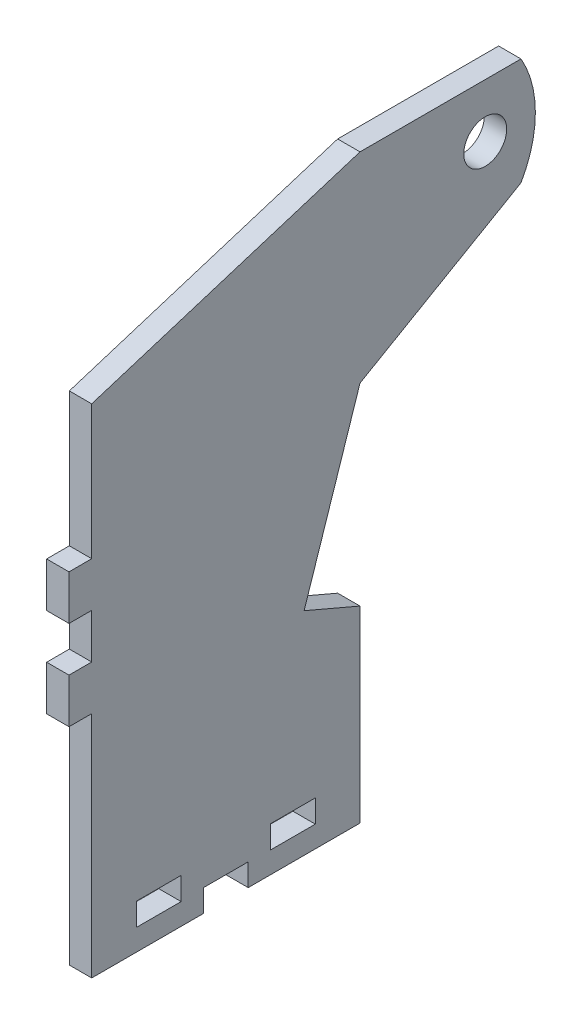
ISO-10303-21;
HEADER;
FILE_DESCRIPTION(('STEP AP214'),'2;1');
FILE_NAME('part.step','',(''),(''),'','','');
FILE_SCHEMA(('AUTOMOTIVE_DESIGN { 1 0 10303 214 1 1 1 1 }'));
ENDSEC;
DATA;
#1=APPLICATION_CONTEXT('core data for automotive mechanical design processes');
#2=APPLICATION_PROTOCOL_DEFINITION('international standard','automotive_design',2000,#1);
#3=PRODUCT_CONTEXT('',#1,'mechanical');
#4=PRODUCT('Part','Part','',(#3));
#5=PRODUCT_RELATED_PRODUCT_CATEGORY('part','',(#4));
#6=PRODUCT_DEFINITION_FORMATION('','',#4);
#7=PRODUCT_DEFINITION_CONTEXT('part definition',#1,'design');
#8=PRODUCT_DEFINITION('design','',#6,#7);
#9=PRODUCT_DEFINITION_SHAPE('','',#8);
#10=(LENGTH_UNIT() NAMED_UNIT(*) SI_UNIT(.MILLI.,.METRE.));
#11=(NAMED_UNIT(*) PLANE_ANGLE_UNIT() SI_UNIT($,.RADIAN.));
#12=(NAMED_UNIT(*) SI_UNIT($,.STERADIAN.) SOLID_ANGLE_UNIT());
#13=UNCERTAINTY_MEASURE_WITH_UNIT(LENGTH_MEASURE(1.E-05),#10,'distance_accuracy_value','');
#14=(GEOMETRIC_REPRESENTATION_CONTEXT(3) GLOBAL_UNCERTAINTY_ASSIGNED_CONTEXT((#13)) GLOBAL_UNIT_ASSIGNED_CONTEXT((#10,
#11,#12)) REPRESENTATION_CONTEXT('',''));
#15=CARTESIAN_POINT('',(0.,0.,0.));
#16=DIRECTION('',(0.,0.,1.));
#17=DIRECTION('',(1.,0.,0.));
#18=AXIS2_PLACEMENT_3D('',#15,#16,#17);
#19=CARTESIAN_POINT('',(3.175,-54.6326713443464,8.90133567217664));
#20=DIRECTION('',(0.,0.,-1.));
#21=DIRECTION('',(0.,1.,0.));
#22=AXIS2_PLACEMENT_3D('',#19,#20,#21);
#23=PLANE('',#22);
#24=DIRECTION('',(0.,-1.,0.));
#25=VECTOR('',#24,1.);
#26=CARTESIAN_POINT('',(0.,-54.6326713443464,8.90133567217664));
#27=LINE('',#26,#25);
#28=CARTESIAN_POINT('',(0.,-9.42067134434636,8.90133567217664));
#29=VERTEX_POINT('',#28);
#30=CARTESIAN_POINT('',(0.,-15.7706713443464,8.90133567217664));
#31=VERTEX_POINT('',#30);
#32=EDGE_CURVE('E295',#29,#31,#27,.T.);
#33=ORIENTED_EDGE('',*,*,#32,.T.);
#34=DIRECTION('',(-1.,0.,0.));
#35=VECTOR('',#34,1.);
#36=CARTESIAN_POINT('',(3.175,-15.7706713443464,8.90133567217664));
#37=LINE('',#36,#35);
#38=CARTESIAN_POINT('',(3.175,-15.7706713443464,8.90133567217664));
#39=VERTEX_POINT('',#38);
#40=EDGE_CURVE('E60',#39,#31,#37,.T.);
#41=ORIENTED_EDGE('',*,*,#40,.F.);
#42=DIRECTION('',(0.,-1.,0.));
#43=VECTOR('',#42,1.);
#44=CARTESIAN_POINT('',(3.175,-54.6326713443464,8.90133567217664));
#45=LINE('',#44,#43);
#46=CARTESIAN_POINT('',(3.175,-9.42067134434636,8.90133567217664));
#47=VERTEX_POINT('',#46);
#48=EDGE_CURVE('E313',#47,#39,#45,.T.);
#49=ORIENTED_EDGE('',*,*,#48,.F.);
#50=DIRECTION('',(-1.,0.,0.));
#51=VECTOR('',#50,1.);
#52=CARTESIAN_POINT('',(3.175,-9.42067134434636,8.90133567217664));
#53=LINE('',#52,#51);
#54=EDGE_CURVE('E287',#47,#29,#53,.T.);
#55=ORIENTED_EDGE('',*,*,#54,.T.);
#56=EDGE_LOOP('',(#33,#41,#49,#55));
#57=FACE_BOUND('',#56,.T.);
#58=ADVANCED_FACE('F35',(#57),#23,.F.);
#59=DIRECTION('',(-1.,0.,0.));
#60=VECTOR('',#59,1.);
#61=CARTESIAN_POINT('',(3.175,-3.07067134434636,8.90133567217664));
#62=LINE('',#61,#60);
#63=CARTESIAN_POINT('',(3.175,-3.07067134434636,8.90133567217664));
#64=VERTEX_POINT('',#63);
#65=CARTESIAN_POINT('',(0.,-3.07067134434636,8.90133567217664));
#66=VERTEX_POINT('',#65);
#67=EDGE_CURVE('E280',#64,#66,#62,.T.);
#68=ORIENTED_EDGE('',*,*,#67,.F.);
#69=CARTESIAN_POINT('',(3.175,15.9793286556536,8.90133567217664));
#70=VERTEX_POINT('',#69);
#71=EDGE_CURVE('E315',#70,#64,#45,.T.);
#72=ORIENTED_EDGE('',*,*,#71,.F.);
#73=DIRECTION('',(-1.,0.,0.));
#74=VECTOR('',#73,1.);
#75=CARTESIAN_POINT('',(3.175,15.9793286556536,8.90133567217664));
#76=LINE('',#75,#74);
#77=CARTESIAN_POINT('',(0.,15.9793286556536,8.90133567217664));
#78=VERTEX_POINT('',#77);
#79=EDGE_CURVE('E823',#70,#78,#76,.T.);
#80=ORIENTED_EDGE('',*,*,#79,.T.);
#81=EDGE_CURVE('E309',#78,#66,#27,.T.);
#82=ORIENTED_EDGE('',*,*,#81,.T.);
#83=EDGE_LOOP('',(#68,#72,#80,#82));
#84=FACE_BOUND('',#83,.T.);
#85=ADVANCED_FACE('F499',(#84),#23,.F.);
#86=CARTESIAN_POINT('',(3.175,-54.6326713443464,8.90133567217664));
#87=DIRECTION('',(0.,1.,0.));
#88=DIRECTION('',(0.,0.,1.));
#89=AXIS2_PLACEMENT_3D('',#86,#87,#88);
#90=PLANE('',#89);
#91=DIRECTION('',(0.,0.,-1.));
#92=VECTOR('',#91,1.);
#93=CARTESIAN_POINT('',(0.,-54.6326713443464,8.90133567217664));
#94=LINE('',#93,#92);
#95=CARTESIAN_POINT('',(0.,-54.6326713443464,8.90133567217664));
#96=VERTEX_POINT('',#95);
#97=CARTESIAN_POINT('',(0.,-54.6326713443464,-6.97366432782337));
#98=VERTEX_POINT('',#97);
#99=EDGE_CURVE('E302',#96,#98,#94,.T.);
#100=ORIENTED_EDGE('',*,*,#99,.T.);
#101=DIRECTION('',(1.,0.,0.));
#102=VECTOR('',#101,1.);
#103=CARTESIAN_POINT('',(0.,-54.6326713443464,-6.97366432782337));
#104=LINE('',#103,#102);
#105=CARTESIAN_POINT('',(3.175,-54.6326713443464,-6.97366432782337));
#106=VERTEX_POINT('',#105);
#107=EDGE_CURVE('E384',#98,#106,#104,.T.);
#108=ORIENTED_EDGE('',*,*,#107,.T.);
#109=DIRECTION('',(0.,0.,-1.));
#110=VECTOR('',#109,1.);
#111=CARTESIAN_POINT('',(3.175,-54.6326713443464,8.90133567217664));
#112=LINE('',#111,#110);
#113=CARTESIAN_POINT('',(3.175,-54.6326713443464,8.90133567217664));
#114=VERTEX_POINT('',#113);
#115=EDGE_CURVE('E321',#114,#106,#112,.T.);
#116=ORIENTED_EDGE('',*,*,#115,.F.);
#117=DIRECTION('',(-1.,0.,0.));
#118=VECTOR('',#117,1.);
#119=CARTESIAN_POINT('',(3.175,-54.6326713443464,8.90133567217664));
#120=LINE('',#119,#118);
#121=EDGE_CURVE('E11',#114,#96,#120,.T.);
#122=ORIENTED_EDGE('',*,*,#121,.T.);
#123=EDGE_LOOP('',(#100,#108,#116,#122));
#124=FACE_BOUND('',#123,.T.);
#125=ADVANCED_FACE('F383',(#124),#90,.F.);
#126=CARTESIAN_POINT('',(3.175,-22.1206713443464,8.90133567217664));
#127=VERTEX_POINT('',#126);
#128=EDGE_CURVE('E39',#127,#114,#45,.T.);
#129=ORIENTED_EDGE('',*,*,#128,.F.);
#130=DIRECTION('',(-1.,0.,0.));
#131=VECTOR('',#130,1.);
#132=CARTESIAN_POINT('',(3.175,-22.1206713443464,8.90133567217664));
#133=LINE('',#132,#131);
#134=CARTESIAN_POINT('',(0.,-22.1206713443464,8.90133567217664));
#135=VERTEX_POINT('',#134);
#136=EDGE_CURVE('E242',#127,#135,#133,.T.);
#137=ORIENTED_EDGE('',*,*,#136,.T.);
#138=EDGE_CURVE('E293',#135,#96,#27,.T.);
#139=ORIENTED_EDGE('',*,*,#138,.T.);
#140=ORIENTED_EDGE('',*,*,#121,.F.);
#141=EDGE_LOOP('',(#129,#137,#139,#140));
#142=FACE_BOUND('',#141,.T.);
#143=ADVANCED_FACE('F37',(#142),#23,.F.);
#144=CARTESIAN_POINT('',(3.175,-54.6326713443464,-13.3236643278234));
#145=VERTEX_POINT('',#144);
#146=CARTESIAN_POINT('',(3.175,-54.6326713443464,-29.1986643278234));
#147=VERTEX_POINT('',#146);
#148=EDGE_CURVE('E327',#145,#147,#112,.T.);
#149=ORIENTED_EDGE('',*,*,#148,.F.);
#150=DIRECTION('',(1.,0.,0.));
#151=VECTOR('',#150,1.);
#152=CARTESIAN_POINT('',(0.,-54.6326713443464,-13.3236643278234));
#153=LINE('',#152,#151);
#154=CARTESIAN_POINT('',(0.,-54.6326713443464,-13.3236643278234));
#155=VERTEX_POINT('',#154);
#156=EDGE_CURVE('E392',#155,#145,#153,.T.);
#157=ORIENTED_EDGE('',*,*,#156,.F.);
#158=CARTESIAN_POINT('',(0.,-54.6326713443464,-29.1986643278234));
#159=VERTEX_POINT('',#158);
#160=EDGE_CURVE('E312',#155,#159,#94,.T.);
#161=ORIENTED_EDGE('',*,*,#160,.T.);
#162=DIRECTION('',(-1.,0.,0.));
#163=VECTOR('',#162,1.);
#164=CARTESIAN_POINT('',(3.175,-54.6326713443464,-29.1986643278234));
#165=LINE('',#164,#163);
#166=EDGE_CURVE('E45',#147,#159,#165,.T.);
#167=ORIENTED_EDGE('',*,*,#166,.F.);
#168=EDGE_LOOP('',(#149,#157,#161,#167));
#169=FACE_BOUND('',#168,.T.);
#170=ADVANCED_FACE('F505',(#169),#90,.F.);
#171=CARTESIAN_POINT('',(3.175,-54.6326713443464,-29.1986643278234));
#172=DIRECTION('',(0.,0.,1.));
#173=DIRECTION('',(1.,0.,0.));
#174=AXIS2_PLACEMENT_3D('',#171,#172,#173);
#175=PLANE('',#174);
#176=DIRECTION('',(0.,1.,0.));
#177=VECTOR('',#176,1.);
#178=CARTESIAN_POINT('',(0.,-54.6326713443464,-29.1986643278234));
#179=LINE('',#178,#177);
#180=CARTESIAN_POINT('',(0.,-27.9395232465611,-29.1986643278234));
#181=VERTEX_POINT('',#180);
#182=EDGE_CURVE('E359',#159,#181,#179,.T.);
#183=ORIENTED_EDGE('',*,*,#182,.T.);
#184=DIRECTION('',(1.,0.,0.));
#185=VECTOR('',#184,1.);
#186=CARTESIAN_POINT('',(0.,-27.9395232465611,-29.1986643278234));
#187=LINE('',#186,#185);
#188=CARTESIAN_POINT('',(3.175,-27.9395232465611,-29.1986643278234));
#189=VERTEX_POINT('',#188);
#190=EDGE_CURVE('E404',#181,#189,#187,.T.);
#191=ORIENTED_EDGE('',*,*,#190,.T.);
#192=DIRECTION('',(0.,1.,0.));
#193=VECTOR('',#192,1.);
#194=CARTESIAN_POINT('',(3.175,-54.6326713443464,-29.1986643278234));
#195=LINE('',#194,#193);
#196=EDGE_CURVE('E326',#147,#189,#195,.T.);
#197=ORIENTED_EDGE('',*,*,#196,.F.);
#198=ORIENTED_EDGE('',*,*,#166,.T.);
#199=EDGE_LOOP('',(#183,#191,#197,#198));
#200=FACE_BOUND('',#199,.T.);
#201=ADVANCED_FACE('F357',(#200),#175,.F.);
#202=CARTESIAN_POINT('',(3.175,12.6773286556536,-52.0586643278234));
#203=DIRECTION('',(0.,0.866025403784436,0.500000000000004));
#204=DIRECTION('',(0.,-0.500000000000004,0.866025403784436));
#205=AXIS2_PLACEMENT_3D('',#202,#203,#204);
#206=PLANE('',#205);
#207=DIRECTION('',(0.,0.500000000000004,-0.866025403784436));
#208=VECTOR('',#207,1.);
#209=CARTESIAN_POINT('',(0.,12.6773286556536,-52.0586643278234));
#210=LINE('',#209,#208);
#211=CARTESIAN_POINT('',(0.,-0.520898498021683,-29.1986643278236));
#212=VERTEX_POINT('',#211);
#213=CARTESIAN_POINT('',(0.,12.6773286556536,-52.0586643278234));
#214=VERTEX_POINT('',#213);
#215=EDGE_CURVE('E371',#212,#214,#210,.T.);
#216=ORIENTED_EDGE('',*,*,#215,.T.);
#217=DIRECTION('',(-1.,0.,0.));
#218=VECTOR('',#217,1.);
#219=CARTESIAN_POINT('',(3.175,12.6773286556536,-52.0586643278234));
#220=LINE('',#219,#218);
#221=CARTESIAN_POINT('',(3.175,12.6773286556536,-52.0586643278234));
#222=VERTEX_POINT('',#221);
#223=EDGE_CURVE('E338',#222,#214,#220,.T.);
#224=ORIENTED_EDGE('',*,*,#223,.F.);
#225=DIRECTION('',(0.,0.500000000000004,-0.866025403784436));
#226=VECTOR('',#225,1.);
#227=CARTESIAN_POINT('',(3.175,12.6773286556536,-52.0586643278234));
#228=LINE('',#227,#226);
#229=CARTESIAN_POINT('',(3.175,-0.520898498021683,-29.1986643278236));
#230=VERTEX_POINT('',#229);
#231=EDGE_CURVE('E330',#230,#222,#228,.T.);
#232=ORIENTED_EDGE('',*,*,#231,.F.);
#233=DIRECTION('',(-1.,0.,0.));
#234=VECTOR('',#233,1.);
#235=CARTESIAN_POINT('',(3.175,-0.520898498021349,-29.1986643278234));
#236=LINE('',#235,#234);
#237=EDGE_CURVE('E343',#230,#212,#236,.T.);
#238=ORIENTED_EDGE('',*,*,#237,.T.);
#239=EDGE_LOOP('',(#216,#224,#232,#238));
#240=FACE_BOUND('',#239,.T.);
#241=ADVANCED_FACE('F515',(#240),#206,.F.);
#242=CARTESIAN_POINT('',(3.175,20.2973286556536,-38.8604371741485));
#243=DIRECTION('',(-1.,0.,0.));
#244=DIRECTION('',(0.,0.,1.));
#245=AXIS2_PLACEMENT_3D('',#242,#243,#244);
#246=CYLINDRICAL_SURFACE('',#245,15.24);
#247=CARTESIAN_POINT('',(0.,20.2973286556536,-38.8604371741485));
#248=DIRECTION('',(1.,0.,0.));
#249=DIRECTION('',(0.,0.,1.));
#250=AXIS2_PLACEMENT_3D('',#247,#248,#249);
#251=CIRCLE('',#250,15.24);
#252=CARTESIAN_POINT('',(0.,27.9173286556536,-52.0586643278234));
#253=VERTEX_POINT('',#252);
#254=EDGE_CURVE('E372',#214,#253,#251,.T.);
#255=ORIENTED_EDGE('',*,*,#254,.T.);
#256=DIRECTION('',(-1.,0.,0.));
#257=VECTOR('',#256,1.);
#258=CARTESIAN_POINT('',(3.175,27.9173286556536,-52.0586643278234));
#259=LINE('',#258,#257);
#260=CARTESIAN_POINT('',(3.175,27.9173286556536,-52.0586643278234));
#261=VERTEX_POINT('',#260);
#262=EDGE_CURVE('E334',#261,#253,#259,.T.);
#263=ORIENTED_EDGE('',*,*,#262,.F.);
#264=CARTESIAN_POINT('',(3.175,20.2973286556536,-38.8604371741485));
#265=DIRECTION('',(1.,0.,0.));
#266=DIRECTION('',(0.,0.,1.));
#267=AXIS2_PLACEMENT_3D('',#264,#265,#266);
#268=CIRCLE('',#267,15.24);
#269=EDGE_CURVE('E331',#222,#261,#268,.T.);
#270=ORIENTED_EDGE('',*,*,#269,.F.);
#271=ORIENTED_EDGE('',*,*,#223,.T.);
#272=EDGE_LOOP('',(#255,#263,#270,#271));
#273=FACE_BOUND('',#272,.T.);
#274=ADVANCED_FACE('F493',(#273),#246,.T.);
#275=CARTESIAN_POINT('',(3.175,27.9173286556536,8.90133567217664));
#276=DIRECTION('',(0.,-1.,0.));
#277=DIRECTION('',(0.,0.,-1.));
#278=AXIS2_PLACEMENT_3D('',#275,#276,#277);
#279=PLANE('',#278);
#280=DIRECTION('',(0.,0.,1.));
#281=VECTOR('',#280,1.);
#282=CARTESIAN_POINT('',(0.,27.9173286556536,8.90133567217664));
#283=LINE('',#282,#281);
#284=CARTESIAN_POINT('',(0.,27.9173286556536,-29.1986643278234));
#285=VERTEX_POINT('',#284);
#286=EDGE_CURVE('E346',#253,#285,#283,.T.);
#287=ORIENTED_EDGE('',*,*,#286,.T.);
#288=DIRECTION('',(-1.,0.,0.));
#289=VECTOR('',#288,1.);
#290=CARTESIAN_POINT('',(3.175,27.9173286556536,-29.1986643278234));
#291=LINE('',#290,#289);
#292=CARTESIAN_POINT('',(3.175,27.9173286556536,-29.1986643278234));
#293=VERTEX_POINT('',#292);
#294=EDGE_CURVE('E841',#293,#285,#291,.T.);
#295=ORIENTED_EDGE('',*,*,#294,.F.);
#296=DIRECTION('',(0.,0.,1.));
#297=VECTOR('',#296,1.);
#298=CARTESIAN_POINT('',(3.175,27.9173286556536,-29.1986643278234));
#299=LINE('',#298,#297);
#300=EDGE_CURVE('E300',#261,#293,#299,.T.);
#301=ORIENTED_EDGE('',*,*,#300,.F.);
#302=ORIENTED_EDGE('',*,*,#262,.T.);
#303=EDGE_LOOP('',(#287,#295,#301,#302));
#304=FACE_BOUND('',#303,.T.);
#305=ADVANCED_FACE('F485',(#304),#279,.F.);
#306=CARTESIAN_POINT('',(3.175,20.2973286556536,-38.8604371741485));
#307=DIRECTION('',(-1.,0.,0.));
#308=DIRECTION('',(0.,0.,1.));
#309=AXIS2_PLACEMENT_3D('',#306,#307,#308);
#310=PLANE('',#309);
#311=DIRECTION('',(0.,0.,1.));
#312=VECTOR('',#311,1.);
#313=CARTESIAN_POINT('',(3.175,-48.3588713443464,-16.4986643278236));
#314=LINE('',#313,#312);
#315=CARTESIAN_POINT('',(3.175,-48.3588713443464,-22.8486643278234));
#316=VERTEX_POINT('',#315);
#317=CARTESIAN_POINT('',(3.175,-48.3588713443464,-16.4986643278236));
#318=VERTEX_POINT('',#317);
#319=EDGE_CURVE('E429',#316,#318,#314,.T.);
#320=ORIENTED_EDGE('',*,*,#319,.F.);
#321=DIRECTION('',(0.,1.,0.));
#322=VECTOR('',#321,1.);
#323=CARTESIAN_POINT('',(3.175,-51.5846713443464,-22.8486643278234));
#324=LINE('',#323,#322);
#325=CARTESIAN_POINT('',(3.175,-51.5846713443464,-22.8486643278234));
#326=VERTEX_POINT('',#325);
#327=EDGE_CURVE('E410',#326,#316,#324,.T.);
#328=ORIENTED_EDGE('',*,*,#327,.F.);
#329=DIRECTION('',(0.,0.,-1.));
#330=VECTOR('',#329,1.);
#331=CARTESIAN_POINT('',(3.175,-51.5846713443464,-16.4986643278234));
#332=LINE('',#331,#330);
#333=CARTESIAN_POINT('',(3.175,-51.5846713443464,-16.4986643278234));
#334=VERTEX_POINT('',#333);
#335=EDGE_CURVE('E418',#334,#326,#332,.T.);
#336=ORIENTED_EDGE('',*,*,#335,.F.);
#337=DIRECTION('',(0.,-1.,0.));
#338=VECTOR('',#337,1.);
#339=CARTESIAN_POINT('',(3.175,-51.5846713443464,-16.4986643278234));
#340=LINE('',#339,#338);
#341=EDGE_CURVE('E432',#318,#334,#340,.T.);
#342=ORIENTED_EDGE('',*,*,#341,.F.);
#343=EDGE_LOOP('',(#320,#328,#336,#342));
#344=FACE_BOUND('',#343,.T.);
#345=DIRECTION('',(0.,0.,1.));
#346=VECTOR('',#345,1.);
#347=CARTESIAN_POINT('',(3.175,-48.3588713443464,2.55133567217644));
#348=LINE('',#347,#346);
#349=CARTESIAN_POINT('',(3.175,-48.3588713443464,-3.79866432782356));
#350=VERTEX_POINT('',#349);
#351=CARTESIAN_POINT('',(3.175,-48.3588713443464,2.55133567217644));
#352=VERTEX_POINT('',#351);
#353=EDGE_CURVE('E461',#350,#352,#348,.T.);
#354=ORIENTED_EDGE('',*,*,#353,.F.);
#355=DIRECTION('',(0.,1.,0.));
#356=VECTOR('',#355,1.);
#357=CARTESIAN_POINT('',(3.175,-51.5846713443464,-3.79866432782356));
#358=LINE('',#357,#356);
#359=CARTESIAN_POINT('',(3.175,-51.5846713443464,-3.79866432782356));
#360=VERTEX_POINT('',#359);
#361=EDGE_CURVE('E439',#360,#350,#358,.T.);
#362=ORIENTED_EDGE('',*,*,#361,.F.);
#363=DIRECTION('',(0.,0.,-1.));
#364=VECTOR('',#363,1.);
#365=CARTESIAN_POINT('',(3.175,-51.5846713443464,2.55133567217644));
#366=LINE('',#365,#364);
#367=CARTESIAN_POINT('',(3.175,-51.5846713443464,2.55133567217644));
#368=VERTEX_POINT('',#367);
#369=EDGE_CURVE('E450',#368,#360,#366,.T.);
#370=ORIENTED_EDGE('',*,*,#369,.F.);
#371=DIRECTION('',(0.,-1.,0.));
#372=VECTOR('',#371,1.);
#373=CARTESIAN_POINT('',(3.175,-51.5846713443464,2.55133567217644));
#374=LINE('',#373,#372);
#375=EDGE_CURVE('E464',#352,#368,#374,.T.);
#376=ORIENTED_EDGE('',*,*,#375,.F.);
#377=EDGE_LOOP('',(#354,#362,#370,#376));
#378=FACE_BOUND('',#377,.T.);
#379=CARTESIAN_POINT('',(3.175,20.2973286556533,-46.9786643278236));
#380=DIRECTION('',(1.,0.,0.));
#381=DIRECTION('',(0.,0.,-1.));
#382=AXIS2_PLACEMENT_3D('',#379,#380,#381);
#383=CIRCLE('',#382,3.048);
#384=CARTESIAN_POINT('',(3.175,20.2973286556533,-50.0266643278236));
#385=VERTEX_POINT('',#384);
#386=EDGE_CURVE('E319',#385,#385,#383,.T.);
#387=ORIENTED_EDGE('',*,*,#386,.F.);
#388=EDGE_LOOP('',(#387));
#389=FACE_BOUND('',#388,.T.);
#390=ORIENTED_EDGE('',*,*,#300,.T.);
#391=DIRECTION('',(0.,-0.298999369990447,0.954253308480152));
#392=VECTOR('',#391,1.);
#393=CARTESIAN_POINT('',(3.175,27.9173286556536,-29.1986643278234));
#394=LINE('',#393,#392);
#395=EDGE_CURVE('E820',#293,#70,#394,.T.);
#396=ORIENTED_EDGE('',*,*,#395,.T.);
#397=ORIENTED_EDGE('',*,*,#71,.T.);
#398=DIRECTION('',(0.,0.,-1.));
#399=VECTOR('',#398,1.);
#400=CARTESIAN_POINT('',(3.175,-3.07067134434636,8.90133567217664));
#401=LINE('',#400,#399);
#402=CARTESIAN_POINT('',(3.175,-3.07067134434636,12.1271356721766));
#403=VERTEX_POINT('',#402);
#404=EDGE_CURVE('E269',#403,#64,#401,.T.);
#405=ORIENTED_EDGE('',*,*,#404,.F.);
#406=DIRECTION('',(0.,1.,0.));
#407=VECTOR('',#406,1.);
#408=CARTESIAN_POINT('',(3.175,-3.07067134434636,12.1271356721766));
#409=LINE('',#408,#407);
#410=CARTESIAN_POINT('',(3.175,-9.42067134434636,12.1271356721766));
#411=VERTEX_POINT('',#410);
#412=EDGE_CURVE('E266',#411,#403,#409,.T.);
#413=ORIENTED_EDGE('',*,*,#412,.F.);
#414=DIRECTION('',(0.,0.,1.));
#415=VECTOR('',#414,1.);
#416=CARTESIAN_POINT('',(3.175,-9.42067134434636,12.1271356721766));
#417=LINE('',#416,#415);
#418=EDGE_CURVE('E270',#47,#411,#417,.T.);
#419=ORIENTED_EDGE('',*,*,#418,.F.);
#420=ORIENTED_EDGE('',*,*,#48,.T.);
#421=DIRECTION('',(0.,0.,-1.));
#422=VECTOR('',#421,1.);
#423=CARTESIAN_POINT('',(3.175,-15.7706713443464,8.90133567217664));
#424=LINE('',#423,#422);
#425=CARTESIAN_POINT('',(3.175,-15.7706713443464,12.1271356721766));
#426=VERTEX_POINT('',#425);
#427=EDGE_CURVE('E250',#426,#39,#424,.T.);
#428=ORIENTED_EDGE('',*,*,#427,.F.);
#429=DIRECTION('',(0.,1.,0.));
#430=VECTOR('',#429,1.);
#431=CARTESIAN_POINT('',(3.175,-15.7706713443464,12.1271356721766));
#432=LINE('',#431,#430);
#433=CARTESIAN_POINT('',(3.175,-22.1206713443464,12.1271356721766));
#434=VERTEX_POINT('',#433);
#435=EDGE_CURVE('E233',#434,#426,#432,.T.);
#436=ORIENTED_EDGE('',*,*,#435,.F.);
#437=DIRECTION('',(0.,0.,1.));
#438=VECTOR('',#437,1.);
#439=CARTESIAN_POINT('',(3.175,-22.1206713443464,12.1271356721766));
#440=LINE('',#439,#438);
#441=EDGE_CURVE('E248',#127,#434,#440,.T.);
#442=ORIENTED_EDGE('',*,*,#441,.F.);
#443=ORIENTED_EDGE('',*,*,#128,.T.);
#444=ORIENTED_EDGE('',*,*,#115,.T.);
#445=DIRECTION('',(0.,-1.,0.));
#446=VECTOR('',#445,1.);
#447=CARTESIAN_POINT('',(3.175,-54.6326713443464,-6.97366432782337));
#448=LINE('',#447,#446);
#449=CARTESIAN_POINT('',(3.175,-51.4576713443464,-6.97366432782337));
#450=VERTEX_POINT('',#449);
#451=EDGE_CURVE('E407',#450,#106,#448,.T.);
#452=ORIENTED_EDGE('',*,*,#451,.F.);
#453=DIRECTION('',(0.,0.,1.));
#454=VECTOR('',#453,1.);
#455=CARTESIAN_POINT('',(3.175,-51.4576713443464,-6.97366432782337));
#456=LINE('',#455,#454);
#457=CARTESIAN_POINT('',(3.175,-51.4576713443464,-13.3236643278234));
#458=VERTEX_POINT('',#457);
#459=EDGE_CURVE('E403',#458,#450,#456,.T.);
#460=ORIENTED_EDGE('',*,*,#459,.F.);
#461=DIRECTION('',(0.,1.,0.));
#462=VECTOR('',#461,1.);
#463=CARTESIAN_POINT('',(3.175,-51.4576713443464,-13.3236643278234));
#464=LINE('',#463,#462);
#465=EDGE_CURVE('E400',#145,#458,#464,.T.);
#466=ORIENTED_EDGE('',*,*,#465,.F.);
#467=ORIENTED_EDGE('',*,*,#148,.T.);
#468=ORIENTED_EDGE('',*,*,#196,.T.);
#469=DIRECTION('',(0.,-0.393182083806029,-0.919460629376782));
#470=VECTOR('',#469,1.);
#471=CARTESIAN_POINT('',(3.175,-24.5434744457513,-21.2569668385571));
#472=LINE('',#471,#470);
#473=CARTESIAN_POINT('',(3.175,-24.5434744457513,-21.2569668385571));
#474=VERTEX_POINT('',#473);
#475=EDGE_CURVE('E848',#474,#189,#472,.T.);
#476=ORIENTED_EDGE('',*,*,#475,.F.);
#477=DIRECTION('',(0.,-0.949460935904681,0.313885219771506));
#478=VECTOR('',#477,1.);
#479=CARTESIAN_POINT('',(3.175,-0.520898498021683,-29.1986643278236));
#480=LINE('',#479,#478);
#481=EDGE_CURVE('E844',#230,#474,#480,.T.);
#482=ORIENTED_EDGE('',*,*,#481,.F.);
#483=ORIENTED_EDGE('',*,*,#231,.T.);
#484=ORIENTED_EDGE('',*,*,#269,.T.);
#485=EDGE_LOOP('',(#390,#396,#397,#405,#413,#419,#420,#428,#436,#442,#443,#444,#452,#460,#466,
#467,#468,#476,#482,#483,#484));
#486=FACE_BOUND('',#485,.T.);
#487=ADVANCED_FACE('F247',(#344,#378,#389,#486),#310,.F.);
#488=CARTESIAN_POINT('',(0.,20.2973286556536,-38.8604371741485));
#489=DIRECTION('',(-1.,0.,0.));
#490=DIRECTION('',(0.,0.,1.));
#491=AXIS2_PLACEMENT_3D('',#488,#489,#490);
#492=PLANE('',#491);
#493=DIRECTION('',(0.,-0.298999369990447,0.954253308480152));
#494=VECTOR('',#493,1.);
#495=CARTESIAN_POINT('',(0.,27.9173286556536,-29.1986643278234));
#496=LINE('',#495,#494);
#497=EDGE_CURVE('E283',#285,#78,#496,.T.);
#498=ORIENTED_EDGE('',*,*,#497,.F.);
#499=ORIENTED_EDGE('',*,*,#286,.F.);
#500=ORIENTED_EDGE('',*,*,#254,.F.);
#501=ORIENTED_EDGE('',*,*,#215,.F.);
#502=DIRECTION('',(0.,-0.949460935904681,0.313885219771506));
#503=VECTOR('',#502,1.);
#504=CARTESIAN_POINT('',(0.,-0.520898498021683,-29.1986643278236));
#505=LINE('',#504,#503);
#506=CARTESIAN_POINT('',(0.,-24.5434744457513,-21.2569668385571));
#507=VERTEX_POINT('',#506);
#508=EDGE_CURVE('E846',#212,#507,#505,.T.);
#509=ORIENTED_EDGE('',*,*,#508,.T.);
#510=DIRECTION('',(0.,-0.393182083806029,-0.919460629376782));
#511=VECTOR('',#510,1.);
#512=CARTESIAN_POINT('',(0.,-24.5434744457513,-21.2569668385571));
#513=LINE('',#512,#511);
#514=EDGE_CURVE('E370',#507,#181,#513,.T.);
#515=ORIENTED_EDGE('',*,*,#514,.T.);
#516=ORIENTED_EDGE('',*,*,#182,.F.);
#517=ORIENTED_EDGE('',*,*,#160,.F.);
#518=DIRECTION('',(0.,1.,0.));
#519=VECTOR('',#518,1.);
#520=CARTESIAN_POINT('',(0.,-51.4576713443464,-13.3236643278234));
#521=LINE('',#520,#519);
#522=CARTESIAN_POINT('',(0.,-51.4576713443464,-13.3236643278234));
#523=VERTEX_POINT('',#522);
#524=EDGE_CURVE('E396',#155,#523,#521,.T.);
#525=ORIENTED_EDGE('',*,*,#524,.T.);
#526=DIRECTION('',(0.,0.,1.));
#527=VECTOR('',#526,1.);
#528=CARTESIAN_POINT('',(0.,-51.4576713443464,-6.97366432782337));
#529=LINE('',#528,#527);
#530=CARTESIAN_POINT('',(0.,-51.4576713443464,-6.97366432782337));
#531=VERTEX_POINT('',#530);
#532=EDGE_CURVE('E390',#523,#531,#529,.T.);
#533=ORIENTED_EDGE('',*,*,#532,.T.);
#534=DIRECTION('',(0.,-1.,0.));
#535=VECTOR('',#534,1.);
#536=CARTESIAN_POINT('',(0.,-54.6326713443464,-6.97366432782337));
#537=LINE('',#536,#535);
#538=EDGE_CURVE('E389',#531,#98,#537,.T.);
#539=ORIENTED_EDGE('',*,*,#538,.T.);
#540=ORIENTED_EDGE('',*,*,#99,.F.);
#541=ORIENTED_EDGE('',*,*,#138,.F.);
#542=DIRECTION('',(0.,0.,1.));
#543=VECTOR('',#542,1.);
#544=CARTESIAN_POINT('',(0.,-22.1206713443464,12.1271356721766));
#545=LINE('',#544,#543);
#546=CARTESIAN_POINT('',(0.,-22.1206713443464,12.1271356721766));
#547=VERTEX_POINT('',#546);
#548=EDGE_CURVE('E259',#135,#547,#545,.T.);
#549=ORIENTED_EDGE('',*,*,#548,.T.);
#550=DIRECTION('',(0.,1.,0.));
#551=VECTOR('',#550,1.);
#552=CARTESIAN_POINT('',(0.,-15.7706713443464,12.1271356721766));
#553=LINE('',#552,#551);
#554=CARTESIAN_POINT('',(0.,-15.7706713443464,12.1271356721766));
#555=VERTEX_POINT('',#554);
#556=EDGE_CURVE('E236',#547,#555,#553,.T.);
#557=ORIENTED_EDGE('',*,*,#556,.T.);
#558=DIRECTION('',(0.,0.,-1.));
#559=VECTOR('',#558,1.);
#560=CARTESIAN_POINT('',(0.,-15.7706713443464,8.90133567217664));
#561=LINE('',#560,#559);
#562=EDGE_CURVE('E253',#555,#31,#561,.T.);
#563=ORIENTED_EDGE('',*,*,#562,.T.);
#564=ORIENTED_EDGE('',*,*,#32,.F.);
#565=DIRECTION('',(0.,0.,1.));
#566=VECTOR('',#565,1.);
#567=CARTESIAN_POINT('',(0.,-9.42067134434636,12.1271356721766));
#568=LINE('',#567,#566);
#569=CARTESIAN_POINT('',(0.,-9.42067134434636,12.1271356721766));
#570=VERTEX_POINT('',#569);
#571=EDGE_CURVE('E263',#29,#570,#568,.T.);
#572=ORIENTED_EDGE('',*,*,#571,.T.);
#573=DIRECTION('',(0.,1.,0.));
#574=VECTOR('',#573,1.);
#575=CARTESIAN_POINT('',(0.,-3.07067134434636,12.1271356721766));
#576=LINE('',#575,#574);
#577=CARTESIAN_POINT('',(0.,-3.07067134434636,12.1271356721766));
#578=VERTEX_POINT('',#577);
#579=EDGE_CURVE('E271',#570,#578,#576,.T.);
#580=ORIENTED_EDGE('',*,*,#579,.T.);
#581=DIRECTION('',(0.,0.,-1.));
#582=VECTOR('',#581,1.);
#583=CARTESIAN_POINT('',(0.,-3.07067134434636,8.90133567217664));
#584=LINE('',#583,#582);
#585=EDGE_CURVE('E274',#578,#66,#584,.T.);
#586=ORIENTED_EDGE('',*,*,#585,.T.);
#587=ORIENTED_EDGE('',*,*,#81,.F.);
#588=EDGE_LOOP('',(#498,#499,#500,#501,#509,#515,#516,#517,#525,#533,#539,#540,#541,#549,#557,
#563,#564,#572,#580,#586,#587));
#589=FACE_BOUND('',#588,.T.);
#590=DIRECTION('',(0.,1.,0.));
#591=VECTOR('',#590,1.);
#592=CARTESIAN_POINT('',(0.,-51.5846713443464,-22.8486643278234));
#593=LINE('',#592,#591);
#594=CARTESIAN_POINT('',(0.,-51.5846713443464,-22.8486643278234));
#595=VERTEX_POINT('',#594);
#596=CARTESIAN_POINT('',(0.,-48.3588713443464,-22.8486643278234));
#597=VERTEX_POINT('',#596);
#598=EDGE_CURVE('E414',#595,#597,#593,.T.);
#599=ORIENTED_EDGE('',*,*,#598,.T.);
#600=DIRECTION('',(0.,0.,1.));
#601=VECTOR('',#600,1.);
#602=CARTESIAN_POINT('',(0.,-48.3588713443464,-16.4986643278236));
#603=LINE('',#602,#601);
#604=CARTESIAN_POINT('',(0.,-48.3588713443464,-16.4986643278236));
#605=VERTEX_POINT('',#604);
#606=EDGE_CURVE('E417',#597,#605,#603,.T.);
#607=ORIENTED_EDGE('',*,*,#606,.T.);
#608=DIRECTION('',(0.,-1.,0.));
#609=VECTOR('',#608,1.);
#610=CARTESIAN_POINT('',(0.,-51.5846713443464,-16.4986643278234));
#611=LINE('',#610,#609);
#612=CARTESIAN_POINT('',(0.,-51.5846713443464,-16.4986643278234));
#613=VERTEX_POINT('',#612);
#614=EDGE_CURVE('E421',#605,#613,#611,.T.);
#615=ORIENTED_EDGE('',*,*,#614,.T.);
#616=DIRECTION('',(0.,0.,-1.));
#617=VECTOR('',#616,1.);
#618=CARTESIAN_POINT('',(0.,-51.5846713443464,-16.4986643278234));
#619=LINE('',#618,#617);
#620=EDGE_CURVE('E424',#613,#595,#619,.T.);
#621=ORIENTED_EDGE('',*,*,#620,.T.);
#622=EDGE_LOOP('',(#599,#607,#615,#621));
#623=FACE_BOUND('',#622,.T.);
#624=DIRECTION('',(0.,1.,0.));
#625=VECTOR('',#624,1.);
#626=CARTESIAN_POINT('',(0.,-51.5846713443464,-3.79866432782356));
#627=LINE('',#626,#625);
#628=CARTESIAN_POINT('',(0.,-51.5846713443464,-3.79866432782356));
#629=VERTEX_POINT('',#628);
#630=CARTESIAN_POINT('',(0.,-48.3588713443464,-3.79866432782356));
#631=VERTEX_POINT('',#630);
#632=EDGE_CURVE('E446',#629,#631,#627,.T.);
#633=ORIENTED_EDGE('',*,*,#632,.T.);
#634=DIRECTION('',(0.,0.,1.));
#635=VECTOR('',#634,1.);
#636=CARTESIAN_POINT('',(0.,-48.3588713443464,2.55133567217644));
#637=LINE('',#636,#635);
#638=CARTESIAN_POINT('',(0.,-48.3588713443463,2.55133567217644));
#639=VERTEX_POINT('',#638);
#640=EDGE_CURVE('E449',#631,#639,#637,.T.);
#641=ORIENTED_EDGE('',*,*,#640,.T.);
#642=DIRECTION('',(0.,-1.,0.));
#643=VECTOR('',#642,1.);
#644=CARTESIAN_POINT('',(0.,-51.5846713443464,2.55133567217644));
#645=LINE('',#644,#643);
#646=CARTESIAN_POINT('',(0.,-51.5846713443464,2.55133567217644));
#647=VERTEX_POINT('',#646);
#648=EDGE_CURVE('E453',#639,#647,#645,.T.);
#649=ORIENTED_EDGE('',*,*,#648,.T.);
#650=DIRECTION('',(0.,0.,-1.));
#651=VECTOR('',#650,1.);
#652=CARTESIAN_POINT('',(0.,-51.5846713443464,2.55133567217644));
#653=LINE('',#652,#651);
#654=EDGE_CURVE('E456',#647,#629,#653,.T.);
#655=ORIENTED_EDGE('',*,*,#654,.T.);
#656=EDGE_LOOP('',(#633,#641,#649,#655));
#657=FACE_BOUND('',#656,.T.);
#658=CARTESIAN_POINT('',(0.,20.2973286556533,-46.9786643278236));
#659=DIRECTION('',(1.,0.,0.));
#660=DIRECTION('',(0.,0.,-1.));
#661=AXIS2_PLACEMENT_3D('',#658,#659,#660);
#662=CIRCLE('',#661,3.048);
#663=CARTESIAN_POINT('',(0.,20.2973286556533,-50.0266643278236));
#664=VERTEX_POINT('',#663);
#665=EDGE_CURVE('E296',#664,#664,#662,.T.);
#666=ORIENTED_EDGE('',*,*,#665,.T.);
#667=EDGE_LOOP('',(#666));
#668=FACE_BOUND('',#667,.T.);
#669=ADVANCED_FACE('F366',(#589,#623,#657,#668),#492,.T.);
#670=CARTESIAN_POINT('',(0.,20.2973286556533,-46.9786643278236));
#671=DIRECTION('',(1.,0.,0.));
#672=DIRECTION('',(0.,0.,-1.));
#673=AXIS2_PLACEMENT_3D('',#670,#671,#672);
#674=CYLINDRICAL_SURFACE('',#673,3.048);
#675=ORIENTED_EDGE('',*,*,#665,.F.);
#676=EDGE_LOOP('',(#675));
#677=FACE_BOUND('',#676,.T.);
#678=ORIENTED_EDGE('',*,*,#386,.T.);
#679=EDGE_LOOP('',(#678));
#680=FACE_BOUND('',#679,.T.);
#681=ADVANCED_FACE('F482',(#677,#680),#674,.F.);
#682=CARTESIAN_POINT('',(0.,-51.5846713443464,-3.79866432782356));
#683=DIRECTION('',(0.,0.,-1.));
#684=DIRECTION('',(0.,1.,0.));
#685=AXIS2_PLACEMENT_3D('',#682,#683,#684);
#686=PLANE('',#685);
#687=ORIENTED_EDGE('',*,*,#361,.T.);
#688=DIRECTION('',(1.,0.,0.));
#689=VECTOR('',#688,1.);
#690=CARTESIAN_POINT('',(0.,-48.3588713443464,-3.79866432782356));
#691=LINE('',#690,#689);
#692=EDGE_CURVE('E459',#631,#350,#691,.T.);
#693=ORIENTED_EDGE('',*,*,#692,.F.);
#694=ORIENTED_EDGE('',*,*,#632,.F.);
#695=DIRECTION('',(1.,0.,0.));
#696=VECTOR('',#695,1.);
#697=CARTESIAN_POINT('',(0.,-51.5846713443464,-3.79866432782356));
#698=LINE('',#697,#696);
#699=EDGE_CURVE('E469',#629,#360,#698,.T.);
#700=ORIENTED_EDGE('',*,*,#699,.T.);
#701=EDGE_LOOP('',(#687,#693,#694,#700));
#702=FACE_BOUND('',#701,.T.);
#703=ADVANCED_FACE('F674',(#702),#686,.F.);
#704=CARTESIAN_POINT('',(0.,-51.5846713443464,2.55133567217644));
#705=DIRECTION('',(0.,-1.,0.));
#706=DIRECTION('',(0.,0.,-1.));
#707=AXIS2_PLACEMENT_3D('',#704,#705,#706);
#708=PLANE('',#707);
#709=ORIENTED_EDGE('',*,*,#369,.T.);
#710=ORIENTED_EDGE('',*,*,#699,.F.);
#711=ORIENTED_EDGE('',*,*,#654,.F.);
#712=DIRECTION('',(1.,0.,0.));
#713=VECTOR('',#712,1.);
#714=CARTESIAN_POINT('',(0.,-51.5846713443464,2.55133567217644));
#715=LINE('',#714,#713);
#716=EDGE_CURVE('E471',#647,#368,#715,.T.);
#717=ORIENTED_EDGE('',*,*,#716,.T.);
#718=EDGE_LOOP('',(#709,#710,#711,#717));
#719=FACE_BOUND('',#718,.T.);
#720=ADVANCED_FACE('F670',(#719),#708,.F.);
#721=CARTESIAN_POINT('',(0.,-51.5846713443464,2.55133567217644));
#722=DIRECTION('',(0.,0.,1.));
#723=DIRECTION('',(0.,-1.,0.));
#724=AXIS2_PLACEMENT_3D('',#721,#722,#723);
#725=PLANE('',#724);
#726=ORIENTED_EDGE('',*,*,#375,.T.);
#727=ORIENTED_EDGE('',*,*,#716,.F.);
#728=ORIENTED_EDGE('',*,*,#648,.F.);
#729=DIRECTION('',(1.,0.,0.));
#730=VECTOR('',#729,1.);
#731=CARTESIAN_POINT('',(0.,-48.3588713443464,2.55133567217644));
#732=LINE('',#731,#730);
#733=EDGE_CURVE('E473',#639,#352,#732,.T.);
#734=ORIENTED_EDGE('',*,*,#733,.T.);
#735=EDGE_LOOP('',(#726,#727,#728,#734));
#736=FACE_BOUND('',#735,.T.);
#737=ADVANCED_FACE('F673',(#736),#725,.F.);
#738=CARTESIAN_POINT('',(0.,-48.3588713443464,2.55133567217644));
#739=DIRECTION('',(0.,1.,0.));
#740=DIRECTION('',(0.,0.,1.));
#741=AXIS2_PLACEMENT_3D('',#738,#739,#740);
#742=PLANE('',#741);
#743=ORIENTED_EDGE('',*,*,#353,.T.);
#744=ORIENTED_EDGE('',*,*,#733,.F.);
#745=ORIENTED_EDGE('',*,*,#640,.F.);
#746=ORIENTED_EDGE('',*,*,#692,.T.);
#747=EDGE_LOOP('',(#743,#744,#745,#746));
#748=FACE_BOUND('',#747,.T.);
#749=ADVANCED_FACE('F668',(#748),#742,.F.);
#750=CARTESIAN_POINT('',(0.,-51.5846713443464,-22.8486643278234));
#751=DIRECTION('',(0.,0.,-1.));
#752=DIRECTION('',(0.,1.,0.));
#753=AXIS2_PLACEMENT_3D('',#750,#751,#752);
#754=PLANE('',#753);
#755=ORIENTED_EDGE('',*,*,#327,.T.);
#756=DIRECTION('',(1.,0.,0.));
#757=VECTOR('',#756,1.);
#758=CARTESIAN_POINT('',(0.,-48.3588713443464,-22.8486643278234));
#759=LINE('',#758,#757);
#760=EDGE_CURVE('E427',#597,#316,#759,.T.);
#761=ORIENTED_EDGE('',*,*,#760,.F.);
#762=ORIENTED_EDGE('',*,*,#598,.F.);
#763=DIRECTION('',(1.,0.,0.));
#764=VECTOR('',#763,1.);
#765=CARTESIAN_POINT('',(0.,-51.5846713443464,-22.8486643278234));
#766=LINE('',#765,#764);
#767=EDGE_CURVE('E437',#595,#326,#766,.T.);
#768=ORIENTED_EDGE('',*,*,#767,.T.);
#769=EDGE_LOOP('',(#755,#761,#762,#768));
#770=FACE_BOUND('',#769,.T.);
#771=ADVANCED_FACE('F658',(#770),#754,.F.);
#772=CARTESIAN_POINT('',(0.,-51.5846713443464,-16.4986643278234));
#773=DIRECTION('',(0.,-1.,0.));
#774=DIRECTION('',(0.,0.,-1.));
#775=AXIS2_PLACEMENT_3D('',#772,#773,#774);
#776=PLANE('',#775);
#777=ORIENTED_EDGE('',*,*,#335,.T.);
#778=ORIENTED_EDGE('',*,*,#767,.F.);
#779=ORIENTED_EDGE('',*,*,#620,.F.);
#780=DIRECTION('',(1.,0.,0.));
#781=VECTOR('',#780,1.);
#782=CARTESIAN_POINT('',(0.,-51.5846713443464,-16.4986643278234));
#783=LINE('',#782,#781);
#784=EDGE_CURVE('E440',#613,#334,#783,.T.);
#785=ORIENTED_EDGE('',*,*,#784,.T.);
#786=EDGE_LOOP('',(#777,#778,#779,#785));
#787=FACE_BOUND('',#786,.T.);
#788=ADVANCED_FACE('F654',(#787),#776,.F.);
#789=CARTESIAN_POINT('',(0.,-51.5846713443464,-16.4986643278234));
#790=DIRECTION('',(0.,0.,1.));
#791=DIRECTION('',(0.,-1.,0.));
#792=AXIS2_PLACEMENT_3D('',#789,#790,#791);
#793=PLANE('',#792);
#794=ORIENTED_EDGE('',*,*,#341,.T.);
#795=ORIENTED_EDGE('',*,*,#784,.F.);
#796=ORIENTED_EDGE('',*,*,#614,.F.);
#797=DIRECTION('',(1.,0.,0.));
#798=VECTOR('',#797,1.);
#799=CARTESIAN_POINT('',(0.,-48.3588713443464,-16.4986643278236));
#800=LINE('',#799,#798);
#801=EDGE_CURVE('E442',#605,#318,#800,.T.);
#802=ORIENTED_EDGE('',*,*,#801,.T.);
#803=EDGE_LOOP('',(#794,#795,#796,#802));
#804=FACE_BOUND('',#803,.T.);
#805=ADVANCED_FACE('F657',(#804),#793,.F.);
#806=CARTESIAN_POINT('',(0.,-48.3588713443464,-16.4986643278236));
#807=DIRECTION('',(0.,1.,0.));
#808=DIRECTION('',(0.,0.,1.));
#809=AXIS2_PLACEMENT_3D('',#806,#807,#808);
#810=PLANE('',#809);
#811=ORIENTED_EDGE('',*,*,#319,.T.);
#812=ORIENTED_EDGE('',*,*,#801,.F.);
#813=ORIENTED_EDGE('',*,*,#606,.F.);
#814=ORIENTED_EDGE('',*,*,#760,.T.);
#815=EDGE_LOOP('',(#811,#812,#813,#814));
#816=FACE_BOUND('',#815,.T.);
#817=ADVANCED_FACE('F647',(#816),#810,.F.);
#818=CARTESIAN_POINT('',(0.,-54.6326713443464,-6.97366432782337));
#819=DIRECTION('',(0.,0.,1.));
#820=DIRECTION('',(1.,0.,0.));
#821=AXIS2_PLACEMENT_3D('',#818,#819,#820);
#822=PLANE('',#821);
#823=ORIENTED_EDGE('',*,*,#451,.T.);
#824=ORIENTED_EDGE('',*,*,#107,.F.);
#825=ORIENTED_EDGE('',*,*,#538,.F.);
#826=DIRECTION('',(1.,0.,0.));
#827=VECTOR('',#826,1.);
#828=CARTESIAN_POINT('',(0.,-51.4576713443464,-6.97366432782337));
#829=LINE('',#828,#827);
#830=EDGE_CURVE('E411',#531,#450,#829,.T.);
#831=ORIENTED_EDGE('',*,*,#830,.T.);
#832=EDGE_LOOP('',(#823,#824,#825,#831));
#833=FACE_BOUND('',#832,.T.);
#834=ADVANCED_FACE('F643',(#833),#822,.F.);
#835=CARTESIAN_POINT('',(0.,-51.4576713443464,-6.97366432782337));
#836=DIRECTION('',(0.,1.,0.));
#837=DIRECTION('',(0.,0.,1.));
#838=AXIS2_PLACEMENT_3D('',#835,#836,#837);
#839=PLANE('',#838);
#840=ORIENTED_EDGE('',*,*,#459,.T.);
#841=ORIENTED_EDGE('',*,*,#830,.F.);
#842=ORIENTED_EDGE('',*,*,#532,.F.);
#843=DIRECTION('',(1.,0.,0.));
#844=VECTOR('',#843,1.);
#845=CARTESIAN_POINT('',(0.,-51.4576713443464,-13.3236643278234));
#846=LINE('',#845,#844);
#847=EDGE_CURVE('E394',#523,#458,#846,.T.);
#848=ORIENTED_EDGE('',*,*,#847,.T.);
#849=EDGE_LOOP('',(#840,#841,#842,#848));
#850=FACE_BOUND('',#849,.T.);
#851=ADVANCED_FACE('F646',(#850),#839,.F.);
#852=CARTESIAN_POINT('',(0.,-51.4576713443464,-13.3236643278234));
#853=DIRECTION('',(0.,0.,-1.));
#854=DIRECTION('',(0.,1.,0.));
#855=AXIS2_PLACEMENT_3D('',#852,#853,#854);
#856=PLANE('',#855);
#857=ORIENTED_EDGE('',*,*,#465,.T.);
#858=ORIENTED_EDGE('',*,*,#847,.F.);
#859=ORIENTED_EDGE('',*,*,#524,.F.);
#860=ORIENTED_EDGE('',*,*,#156,.T.);
#861=EDGE_LOOP('',(#857,#858,#859,#860));
#862=FACE_BOUND('',#861,.T.);
#863=ADVANCED_FACE('F639',(#862),#856,.F.);
#864=CARTESIAN_POINT('',(0.,-24.5434744457513,-21.2569668385571));
#865=DIRECTION('',(0.,-0.919460629376783,0.393182083806029));
#866=DIRECTION('',(0.,-0.393182083806029,-0.919460629376783));
#867=AXIS2_PLACEMENT_3D('',#864,#865,#866);
#868=PLANE('',#867);
#869=ORIENTED_EDGE('',*,*,#475,.T.);
#870=ORIENTED_EDGE('',*,*,#190,.F.);
#871=ORIENTED_EDGE('',*,*,#514,.F.);
#872=DIRECTION('',(1.,0.,0.));
#873=VECTOR('',#872,1.);
#874=CARTESIAN_POINT('',(0.,-24.5434744457513,-21.2569668385571));
#875=LINE('',#874,#873);
#876=EDGE_CURVE('E850',#507,#474,#875,.T.);
#877=ORIENTED_EDGE('',*,*,#876,.T.);
#878=EDGE_LOOP('',(#869,#870,#871,#877));
#879=FACE_BOUND('',#878,.T.);
#880=ADVANCED_FACE('F636',(#879),#868,.F.);
#881=CARTESIAN_POINT('',(0.,-0.520898498021683,-29.1986643278236));
#882=DIRECTION('',(0.,0.313885219771507,0.949460935904681));
#883=DIRECTION('',(0.,-0.949460935904681,0.313885219771506));
#884=AXIS2_PLACEMENT_3D('',#881,#882,#883);
#885=PLANE('',#884);
#886=ORIENTED_EDGE('',*,*,#481,.T.);
#887=ORIENTED_EDGE('',*,*,#876,.F.);
#888=ORIENTED_EDGE('',*,*,#508,.F.);
#889=ORIENTED_EDGE('',*,*,#237,.F.);
#890=EDGE_LOOP('',(#886,#887,#888,#889));
#891=FACE_BOUND('',#890,.T.);
#892=ADVANCED_FACE('F537',(#891),#885,.F.);
#893=CARTESIAN_POINT('',(3.175,27.9173286556536,-29.1986643278234));
#894=DIRECTION('',(0.,-0.954253308480152,-0.298999369990447));
#895=DIRECTION('',(0.,0.298999369990448,-0.954253308480152));
#896=AXIS2_PLACEMENT_3D('',#893,#894,#895);
#897=PLANE('',#896);
#898=ORIENTED_EDGE('',*,*,#497,.T.);
#899=ORIENTED_EDGE('',*,*,#79,.F.);
#900=ORIENTED_EDGE('',*,*,#395,.F.);
#901=ORIENTED_EDGE('',*,*,#294,.T.);
#902=EDGE_LOOP('',(#898,#899,#900,#901));
#903=FACE_BOUND('',#902,.T.);
#904=ADVANCED_FACE('F542',(#903),#897,.F.);
#905=CARTESIAN_POINT('',(3.175,-3.07067134434636,8.90133567217664));
#906=DIRECTION('',(0.,1.,0.));
#907=DIRECTION('',(0.,0.,1.));
#908=AXIS2_PLACEMENT_3D('',#905,#906,#907);
#909=PLANE('',#908);
#910=ORIENTED_EDGE('',*,*,#585,.F.);
#911=DIRECTION('',(-1.,0.,0.));
#912=VECTOR('',#911,1.);
#913=CARTESIAN_POINT('',(3.175,-3.07067134434636,12.1271356721766));
#914=LINE('',#913,#912);
#915=EDGE_CURVE('E277',#403,#578,#914,.T.);
#916=ORIENTED_EDGE('',*,*,#915,.F.);
#917=ORIENTED_EDGE('',*,*,#404,.T.);
#918=ORIENTED_EDGE('',*,*,#67,.T.);
#919=EDGE_LOOP('',(#910,#916,#917,#918));
#920=FACE_BOUND('',#919,.T.);
#921=ADVANCED_FACE('F546',(#920),#909,.T.);
#922=CARTESIAN_POINT('',(3.175,-3.07067134434636,12.1271356721766));
#923=DIRECTION('',(0.,0.,1.));
#924=DIRECTION('',(1.,0.,0.));
#925=AXIS2_PLACEMENT_3D('',#922,#923,#924);
#926=PLANE('',#925);
#927=ORIENTED_EDGE('',*,*,#579,.F.);
#928=DIRECTION('',(-1.,0.,0.));
#929=VECTOR('',#928,1.);
#930=CARTESIAN_POINT('',(3.175,-9.42067134434636,12.1271356721766));
#931=LINE('',#930,#929);
#932=EDGE_CURVE('E829',#411,#570,#931,.T.);
#933=ORIENTED_EDGE('',*,*,#932,.F.);
#934=ORIENTED_EDGE('',*,*,#412,.T.);
#935=ORIENTED_EDGE('',*,*,#915,.T.);
#936=EDGE_LOOP('',(#927,#933,#934,#935));
#937=FACE_BOUND('',#936,.T.);
#938=ADVANCED_FACE('F585',(#937),#926,.T.);
#939=CARTESIAN_POINT('',(3.175,-9.42067134434636,12.1271356721766));
#940=DIRECTION('',(0.,-1.,0.));
#941=DIRECTION('',(0.,0.,-1.));
#942=AXIS2_PLACEMENT_3D('',#939,#940,#941);
#943=PLANE('',#942);
#944=ORIENTED_EDGE('',*,*,#571,.F.);
#945=ORIENTED_EDGE('',*,*,#54,.F.);
#946=ORIENTED_EDGE('',*,*,#418,.T.);
#947=ORIENTED_EDGE('',*,*,#932,.T.);
#948=EDGE_LOOP('',(#944,#945,#946,#947));
#949=FACE_BOUND('',#948,.T.);
#950=ADVANCED_FACE('F595',(#949),#943,.T.);
#951=CARTESIAN_POINT('',(3.175,-15.7706713443464,8.90133567217664));
#952=DIRECTION('',(0.,1.,0.));
#953=DIRECTION('',(0.,0.,1.));
#954=AXIS2_PLACEMENT_3D('',#951,#952,#953);
#955=PLANE('',#954);
#956=ORIENTED_EDGE('',*,*,#562,.F.);
#957=DIRECTION('',(-1.,0.,0.));
#958=VECTOR('',#957,1.);
#959=CARTESIAN_POINT('',(3.175,-15.7706713443464,12.1271356721766));
#960=LINE('',#959,#958);
#961=EDGE_CURVE('E241',#426,#555,#960,.T.);
#962=ORIENTED_EDGE('',*,*,#961,.F.);
#963=ORIENTED_EDGE('',*,*,#427,.T.);
#964=ORIENTED_EDGE('',*,*,#40,.T.);
#965=EDGE_LOOP('',(#956,#962,#963,#964));
#966=FACE_BOUND('',#965,.T.);
#967=ADVANCED_FACE('F605',(#966),#955,.T.);
#968=CARTESIAN_POINT('',(3.175,-15.7706713443464,12.1271356721766));
#969=DIRECTION('',(0.,0.,1.));
#970=DIRECTION('',(0.,-1.,0.));
#971=AXIS2_PLACEMENT_3D('',#968,#969,#970);
#972=PLANE('',#971);
#973=ORIENTED_EDGE('',*,*,#556,.F.);
#974=DIRECTION('',(-1.,0.,0.));
#975=VECTOR('',#974,1.);
#976=CARTESIAN_POINT('',(3.175,-22.1206713443464,12.1271356721766));
#977=LINE('',#976,#975);
#978=EDGE_CURVE('E230',#434,#547,#977,.T.);
#979=ORIENTED_EDGE('',*,*,#978,.F.);
#980=ORIENTED_EDGE('',*,*,#435,.T.);
#981=ORIENTED_EDGE('',*,*,#961,.T.);
#982=EDGE_LOOP('',(#973,#979,#980,#981));
#983=FACE_BOUND('',#982,.T.);
#984=ADVANCED_FACE('F232',(#983),#972,.T.);
#985=CARTESIAN_POINT('',(3.175,-22.1206713443464,12.1271356721766));
#986=DIRECTION('',(0.,-1.,0.));
#987=DIRECTION('',(0.,0.,-1.));
#988=AXIS2_PLACEMENT_3D('',#985,#986,#987);
#989=PLANE('',#988);
#990=ORIENTED_EDGE('',*,*,#548,.F.);
#991=ORIENTED_EDGE('',*,*,#136,.F.);
#992=ORIENTED_EDGE('',*,*,#441,.T.);
#993=ORIENTED_EDGE('',*,*,#978,.T.);
#994=EDGE_LOOP('',(#990,#991,#992,#993));
#995=FACE_BOUND('',#994,.T.);
#996=ADVANCED_FACE('F252',(#995),#989,.T.);
#997=CLOSED_SHELL('',(#58,#85,#125,#143,#170,#201,#241,#274,#305,#487,#669,#681,#703,#720,#737,
#749,#771,#788,#805,#817,#834,#851,#863,#880,#892,#904,#921,#938,#950,#967,#984,#996));
#998=MANIFOLD_SOLID_BREP('B2',#997);
#999=ADVANCED_BREP_SHAPE_REPRESENTATION('',(#18,#998),#14);
#1000=SHAPE_DEFINITION_REPRESENTATION(#9,#999);
ENDSEC;
END-ISO-10303-21;
